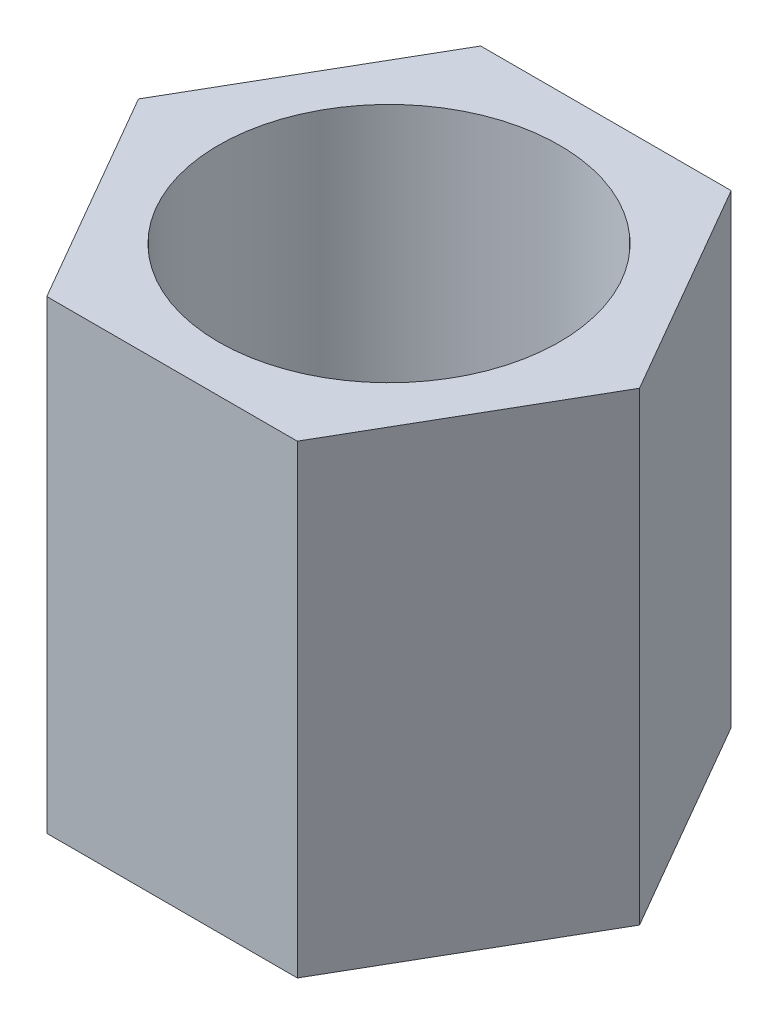
ISO-10303-21;
HEADER;
FILE_DESCRIPTION(('STEP AP214'),'2;1');
FILE_NAME('part.step','',(''),(''),'','','');
FILE_SCHEMA(('AUTOMOTIVE_DESIGN { 1 0 10303 214 1 1 1 1 }'));
ENDSEC;
DATA;
#1=APPLICATION_CONTEXT('core data for automotive mechanical design processes');
#2=APPLICATION_PROTOCOL_DEFINITION('international standard','automotive_design',2000,#1);
#3=PRODUCT_CONTEXT('',#1,'mechanical');
#4=PRODUCT('Part','Part','',(#3));
#5=PRODUCT_RELATED_PRODUCT_CATEGORY('part','',(#4));
#6=PRODUCT_DEFINITION_FORMATION('','',#4);
#7=PRODUCT_DEFINITION_CONTEXT('part definition',#1,'design');
#8=PRODUCT_DEFINITION('design','',#6,#7);
#9=PRODUCT_DEFINITION_SHAPE('','',#8);
#10=(LENGTH_UNIT() NAMED_UNIT(*) SI_UNIT(.MILLI.,.METRE.));
#11=(NAMED_UNIT(*) PLANE_ANGLE_UNIT() SI_UNIT($,.RADIAN.));
#12=(NAMED_UNIT(*) SI_UNIT($,.STERADIAN.) SOLID_ANGLE_UNIT());
#13=UNCERTAINTY_MEASURE_WITH_UNIT(LENGTH_MEASURE(1.E-05),#10,'distance_accuracy_value','');
#14=(GEOMETRIC_REPRESENTATION_CONTEXT(3) GLOBAL_UNCERTAINTY_ASSIGNED_CONTEXT((#13)) GLOBAL_UNIT_ASSIGNED_CONTEXT((#10,
#11,#12)) REPRESENTATION_CONTEXT('',''));
#15=CARTESIAN_POINT('',(0.,0.,0.));
#16=DIRECTION('',(0.,0.,1.));
#17=DIRECTION('',(1.,0.,0.));
#18=AXIS2_PLACEMENT_3D('',#15,#16,#17);
#19=CARTESIAN_POINT('',(0.808290376865476,3.,1.4));
#20=DIRECTION('',(-0.866025403784439,0.,-0.499999999999999));
#21=DIRECTION('',(-0.499999999999999,0.,0.866025403784439));
#22=AXIS2_PLACEMENT_3D('',#19,#20,#21);
#23=PLANE('',#22);
#24=DIRECTION('',(0.499999999999999,0.,-0.866025403784439));
#25=VECTOR('',#24,1.);
#26=CARTESIAN_POINT('',(0.808290376865476,0.,1.4));
#27=LINE('',#26,#25);
#28=CARTESIAN_POINT('',(0.808290376865476,0.,1.4));
#29=VERTEX_POINT('',#28);
#30=CARTESIAN_POINT('',(1.61658075373095,0.,0.));
#31=VERTEX_POINT('',#30);
#32=EDGE_CURVE('E119',#29,#31,#27,.T.);
#33=ORIENTED_EDGE('',*,*,#32,.T.);
#34=DIRECTION('',(0.,-1.,0.));
#35=VECTOR('',#34,1.);
#36=CARTESIAN_POINT('',(1.61658075373095,3.,0.));
#37=LINE('',#36,#35);
#38=CARTESIAN_POINT('',(1.61658075373095,3.,0.));
#39=VERTEX_POINT('',#38);
#40=EDGE_CURVE('E11',#39,#31,#37,.T.);
#41=ORIENTED_EDGE('',*,*,#40,.F.);
#42=DIRECTION('',(0.499999999999999,0.,-0.866025403784439));
#43=VECTOR('',#42,1.);
#44=CARTESIAN_POINT('',(0.808290376865476,3.,1.4));
#45=LINE('',#44,#43);
#46=CARTESIAN_POINT('',(0.808290376865476,3.,1.4));
#47=VERTEX_POINT('',#46);
#48=EDGE_CURVE('E130',#47,#39,#45,.T.);
#49=ORIENTED_EDGE('',*,*,#48,.F.);
#50=DIRECTION('',(0.,-1.,0.));
#51=VECTOR('',#50,1.);
#52=CARTESIAN_POINT('',(0.808290376865476,3.,1.4));
#53=LINE('',#52,#51);
#54=EDGE_CURVE('E115',#47,#29,#53,.T.);
#55=ORIENTED_EDGE('',*,*,#54,.T.);
#56=EDGE_LOOP('',(#33,#41,#49,#55));
#57=FACE_BOUND('',#56,.T.);
#58=ADVANCED_FACE('F35',(#57),#23,.F.);
#59=CARTESIAN_POINT('',(1.61658075373095,3.,0.));
#60=DIRECTION('',(-0.866025403784438,0.,0.5));
#61=DIRECTION('',(0.5,0.,0.866025403784439));
#62=AXIS2_PLACEMENT_3D('',#59,#60,#61);
#63=PLANE('',#62);
#64=DIRECTION('',(-0.5,0.,-0.866025403784439));
#65=VECTOR('',#64,1.);
#66=CARTESIAN_POINT('',(1.61658075373095,0.,0.));
#67=LINE('',#66,#65);
#68=CARTESIAN_POINT('',(0.808290376865474,0.,-1.4));
#69=VERTEX_POINT('',#68);
#70=EDGE_CURVE('E122',#31,#69,#67,.T.);
#71=ORIENTED_EDGE('',*,*,#70,.T.);
#72=DIRECTION('',(0.,-1.,0.));
#73=VECTOR('',#72,1.);
#74=CARTESIAN_POINT('',(0.808290376865474,3.,-1.4));
#75=LINE('',#74,#73);
#76=CARTESIAN_POINT('',(0.808290376865474,3.,-1.4));
#77=VERTEX_POINT('',#76);
#78=EDGE_CURVE('E43',#77,#69,#75,.T.);
#79=ORIENTED_EDGE('',*,*,#78,.F.);
#80=DIRECTION('',(-0.5,0.,-0.866025403784439));
#81=VECTOR('',#80,1.);
#82=CARTESIAN_POINT('',(1.61658075373095,3.,0.));
#83=LINE('',#82,#81);
#84=EDGE_CURVE('E88',#39,#77,#83,.T.);
#85=ORIENTED_EDGE('',*,*,#84,.F.);
#86=ORIENTED_EDGE('',*,*,#40,.T.);
#87=EDGE_LOOP('',(#71,#79,#85,#86));
#88=FACE_BOUND('',#87,.T.);
#89=ADVANCED_FACE('F155',(#88),#63,.F.);
#90=CARTESIAN_POINT('',(0.808290376865474,3.,-1.4));
#91=DIRECTION('',(0.,0.,1.));
#92=DIRECTION('',(1.,0.,0.));
#93=AXIS2_PLACEMENT_3D('',#90,#91,#92);
#94=PLANE('',#93);
#95=DIRECTION('',(-1.,0.,0.));
#96=VECTOR('',#95,1.);
#97=CARTESIAN_POINT('',(0.808290376865474,0.,-1.4));
#98=LINE('',#97,#96);
#99=CARTESIAN_POINT('',(-0.808290376865477,0.,-1.4));
#100=VERTEX_POINT('',#99);
#101=EDGE_CURVE('E125',#69,#100,#98,.T.);
#102=ORIENTED_EDGE('',*,*,#101,.T.);
#103=DIRECTION('',(0.,-1.,0.));
#104=VECTOR('',#103,1.);
#105=CARTESIAN_POINT('',(-0.808290376865477,3.,-1.4));
#106=LINE('',#105,#104);
#107=CARTESIAN_POINT('',(-0.808290376865477,3.,-1.4));
#108=VERTEX_POINT('',#107);
#109=EDGE_CURVE('E110',#108,#100,#106,.T.);
#110=ORIENTED_EDGE('',*,*,#109,.F.);
#111=DIRECTION('',(-1.,0.,0.));
#112=VECTOR('',#111,1.);
#113=CARTESIAN_POINT('',(0.808290376865474,3.,-1.4));
#114=LINE('',#113,#112);
#115=EDGE_CURVE('E101',#77,#108,#114,.T.);
#116=ORIENTED_EDGE('',*,*,#115,.F.);
#117=ORIENTED_EDGE('',*,*,#78,.T.);
#118=EDGE_LOOP('',(#102,#110,#116,#117));
#119=FACE_BOUND('',#118,.T.);
#120=ADVANCED_FACE('F136',(#119),#94,.F.);
#121=CARTESIAN_POINT('',(-0.808290376865477,3.,-1.4));
#122=DIRECTION('',(0.866025403784439,0.,0.5));
#123=DIRECTION('',(0.5,0.,-0.866025403784439));
#124=AXIS2_PLACEMENT_3D('',#121,#122,#123);
#125=PLANE('',#124);
#126=DIRECTION('',(-0.5,0.,0.866025403784439));
#127=VECTOR('',#126,1.);
#128=CARTESIAN_POINT('',(-0.808290376865477,0.,-1.4));
#129=LINE('',#128,#127);
#130=CARTESIAN_POINT('',(-1.61658075373095,0.,0.));
#131=VERTEX_POINT('',#130);
#132=EDGE_CURVE('E109',#100,#131,#129,.T.);
#133=ORIENTED_EDGE('',*,*,#132,.T.);
#134=DIRECTION('',(0.,-1.,0.));
#135=VECTOR('',#134,1.);
#136=CARTESIAN_POINT('',(-1.61658075373095,3.,0.));
#137=LINE('',#136,#135);
#138=CARTESIAN_POINT('',(-1.61658075373095,3.,0.));
#139=VERTEX_POINT('',#138);
#140=EDGE_CURVE('E106',#139,#131,#137,.T.);
#141=ORIENTED_EDGE('',*,*,#140,.F.);
#142=DIRECTION('',(-0.5,0.,0.866025403784439));
#143=VECTOR('',#142,1.);
#144=CARTESIAN_POINT('',(-0.808290376865477,3.,-1.4));
#145=LINE('',#144,#143);
#146=EDGE_CURVE('E95',#108,#139,#145,.T.);
#147=ORIENTED_EDGE('',*,*,#146,.F.);
#148=ORIENTED_EDGE('',*,*,#109,.T.);
#149=EDGE_LOOP('',(#133,#141,#147,#148));
#150=FACE_BOUND('',#149,.T.);
#151=ADVANCED_FACE('F107',(#150),#125,.F.);
#152=CARTESIAN_POINT('',(-1.61658075373095,3.,0.));
#153=DIRECTION('',(0.866025403784438,0.,-0.5));
#154=DIRECTION('',(-0.5,0.,-0.866025403784439));
#155=AXIS2_PLACEMENT_3D('',#152,#153,#154);
#156=PLANE('',#155);
#157=DIRECTION('',(0.5,0.,0.866025403784438));
#158=VECTOR('',#157,1.);
#159=CARTESIAN_POINT('',(-1.61658075373095,0.,0.));
#160=LINE('',#159,#158);
#161=CARTESIAN_POINT('',(-0.808290376865477,0.,1.4));
#162=VERTEX_POINT('',#161);
#163=EDGE_CURVE('E74',#131,#162,#160,.T.);
#164=ORIENTED_EDGE('',*,*,#163,.T.);
#165=DIRECTION('',(0.,-1.,0.));
#166=VECTOR('',#165,1.);
#167=CARTESIAN_POINT('',(-0.808290376865477,3.,1.4));
#168=LINE('',#167,#166);
#169=CARTESIAN_POINT('',(-0.808290376865477,3.,1.4));
#170=VERTEX_POINT('',#169);
#171=EDGE_CURVE('E111',#170,#162,#168,.T.);
#172=ORIENTED_EDGE('',*,*,#171,.F.);
#173=DIRECTION('',(0.5,0.,0.866025403784438));
#174=VECTOR('',#173,1.);
#175=CARTESIAN_POINT('',(-1.61658075373095,3.,0.));
#176=LINE('',#175,#174);
#177=EDGE_CURVE('E99',#139,#170,#176,.T.);
#178=ORIENTED_EDGE('',*,*,#177,.F.);
#179=ORIENTED_EDGE('',*,*,#140,.T.);
#180=EDGE_LOOP('',(#164,#172,#178,#179));
#181=FACE_BOUND('',#180,.T.);
#182=ADVANCED_FACE('F113',(#181),#156,.F.);
#183=CARTESIAN_POINT('',(-0.808290376865477,3.,1.4));
#184=DIRECTION('',(0.,0.,-1.));
#185=DIRECTION('',(-1.,0.,0.));
#186=AXIS2_PLACEMENT_3D('',#183,#184,#185);
#187=PLANE('',#186);
#188=DIRECTION('',(1.,0.,0.));
#189=VECTOR('',#188,1.);
#190=CARTESIAN_POINT('',(-0.808290376865477,0.,1.4));
#191=LINE('',#190,#189);
#192=EDGE_CURVE('E80',#162,#29,#191,.T.);
#193=ORIENTED_EDGE('',*,*,#192,.T.);
#194=ORIENTED_EDGE('',*,*,#54,.F.);
#195=DIRECTION('',(1.,0.,0.));
#196=VECTOR('',#195,1.);
#197=CARTESIAN_POINT('',(-0.808290376865477,3.,1.4));
#198=LINE('',#197,#196);
#199=EDGE_CURVE('E51',#170,#47,#198,.T.);
#200=ORIENTED_EDGE('',*,*,#199,.F.);
#201=ORIENTED_EDGE('',*,*,#171,.T.);
#202=EDGE_LOOP('',(#193,#194,#200,#201));
#203=FACE_BOUND('',#202,.T.);
#204=ADVANCED_FACE('F143',(#203),#187,.F.);
#205=CARTESIAN_POINT('',(0.,3.,0.));
#206=DIRECTION('',(0.,1.,0.));
#207=DIRECTION('',(0.,0.,1.));
#208=AXIS2_PLACEMENT_3D('',#205,#206,#207);
#209=PLANE('',#208);
#210=CARTESIAN_POINT('',(0.,3.,0.));
#211=DIRECTION('',(0.,1.,0.));
#212=DIRECTION('',(0.,0.,1.));
#213=AXIS2_PLACEMENT_3D('',#210,#211,#212);
#214=CIRCLE('',#213,1.1);
#215=CARTESIAN_POINT('',(0.,3.,1.1));
#216=VERTEX_POINT('',#215);
#217=EDGE_CURVE('E210',#216,#216,#214,.T.);
#218=ORIENTED_EDGE('',*,*,#217,.F.);
#219=EDGE_LOOP('',(#218));
#220=FACE_BOUND('',#219,.T.);
#221=ORIENTED_EDGE('',*,*,#48,.T.);
#222=ORIENTED_EDGE('',*,*,#84,.T.);
#223=ORIENTED_EDGE('',*,*,#115,.T.);
#224=ORIENTED_EDGE('',*,*,#146,.T.);
#225=ORIENTED_EDGE('',*,*,#177,.T.);
#226=ORIENTED_EDGE('',*,*,#199,.T.);
#227=EDGE_LOOP('',(#221,#222,#223,#224,#225,#226));
#228=FACE_BOUND('',#227,.T.);
#229=ADVANCED_FACE('F97',(#220,#228),#209,.T.);
#230=CARTESIAN_POINT('',(0.,0.,0.));
#231=DIRECTION('',(0.,1.,0.));
#232=DIRECTION('',(0.,0.,1.));
#233=AXIS2_PLACEMENT_3D('',#230,#231,#232);
#234=PLANE('',#233);
#235=CARTESIAN_POINT('',(0.,0.,0.));
#236=DIRECTION('',(0.,1.,0.));
#237=DIRECTION('',(0.,0.,1.));
#238=AXIS2_PLACEMENT_3D('',#235,#236,#237);
#239=CIRCLE('',#238,1.1);
#240=CARTESIAN_POINT('',(0.,0.,1.1));
#241=VERTEX_POINT('',#240);
#242=EDGE_CURVE('E123',#241,#241,#239,.T.);
#243=ORIENTED_EDGE('',*,*,#242,.T.);
#244=EDGE_LOOP('',(#243));
#245=FACE_BOUND('',#244,.T.);
#246=ORIENTED_EDGE('',*,*,#32,.F.);
#247=ORIENTED_EDGE('',*,*,#192,.F.);
#248=ORIENTED_EDGE('',*,*,#163,.F.);
#249=ORIENTED_EDGE('',*,*,#132,.F.);
#250=ORIENTED_EDGE('',*,*,#101,.F.);
#251=ORIENTED_EDGE('',*,*,#70,.F.);
#252=EDGE_LOOP('',(#246,#247,#248,#249,#250,#251));
#253=FACE_BOUND('',#252,.T.);
#254=ADVANCED_FACE('F139',(#245,#253),#234,.F.);
#255=CARTESIAN_POINT('',(0.,0.,0.));
#256=DIRECTION('',(0.,1.,0.));
#257=DIRECTION('',(0.,0.,1.));
#258=AXIS2_PLACEMENT_3D('',#255,#256,#257);
#259=CYLINDRICAL_SURFACE('',#258,1.1);
#260=ORIENTED_EDGE('',*,*,#242,.F.);
#261=EDGE_LOOP('',(#260));
#262=FACE_BOUND('',#261,.T.);
#263=ORIENTED_EDGE('',*,*,#217,.T.);
#264=EDGE_LOOP('',(#263));
#265=FACE_BOUND('',#264,.T.);
#266=ADVANCED_FACE('F192',(#262,#265),#259,.F.);
#267=CLOSED_SHELL('',(#58,#89,#120,#151,#182,#204,#229,#254,#266));
#268=MANIFOLD_SOLID_BREP('B2',#267);
#269=ADVANCED_BREP_SHAPE_REPRESENTATION('',(#18,#268),#14);
#270=SHAPE_DEFINITION_REPRESENTATION(#9,#269);
ENDSEC;
END-ISO-10303-21;
